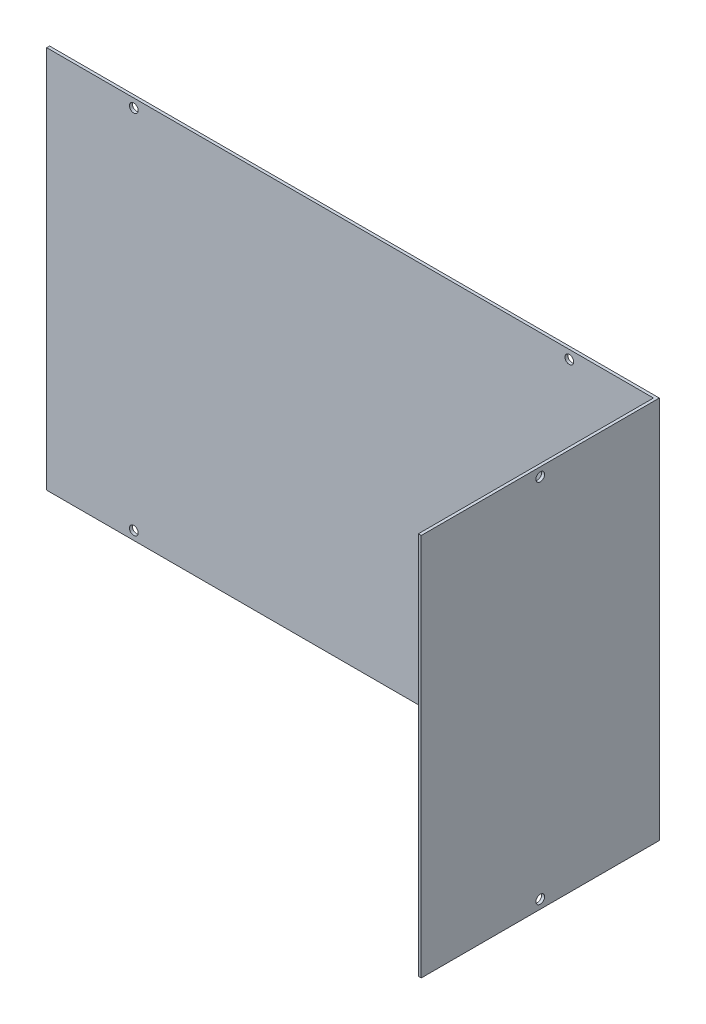
ISO-10303-21;
HEADER;
FILE_DESCRIPTION(('STEP AP214'),'2;1');
FILE_NAME('part.step','',(''),(''),'','','');
FILE_SCHEMA(('AUTOMOTIVE_DESIGN { 1 0 10303 214 1 1 1 1 }'));
ENDSEC;
DATA;
#1=APPLICATION_CONTEXT('core data for automotive mechanical design processes');
#2=APPLICATION_PROTOCOL_DEFINITION('international standard','automotive_design',2000,#1);
#3=PRODUCT_CONTEXT('',#1,'mechanical');
#4=PRODUCT('Part','Part','',(#3));
#5=PRODUCT_RELATED_PRODUCT_CATEGORY('part','',(#4));
#6=PRODUCT_DEFINITION_FORMATION('','',#4);
#7=PRODUCT_DEFINITION_CONTEXT('part definition',#1,'design');
#8=PRODUCT_DEFINITION('design','',#6,#7);
#9=PRODUCT_DEFINITION_SHAPE('','',#8);
#10=(LENGTH_UNIT() NAMED_UNIT(*) SI_UNIT(.MILLI.,.METRE.));
#11=(NAMED_UNIT(*) PLANE_ANGLE_UNIT() SI_UNIT($,.RADIAN.));
#12=(NAMED_UNIT(*) SI_UNIT($,.STERADIAN.) SOLID_ANGLE_UNIT());
#13=UNCERTAINTY_MEASURE_WITH_UNIT(LENGTH_MEASURE(1.E-05),#10,'distance_accuracy_value','');
#14=(GEOMETRIC_REPRESENTATION_CONTEXT(3) GLOBAL_UNCERTAINTY_ASSIGNED_CONTEXT((#13)) GLOBAL_UNIT_ASSIGNED_CONTEXT((#10,
#11,#12)) REPRESENTATION_CONTEXT('',''));
#15=CARTESIAN_POINT('',(0.,0.,0.));
#16=DIRECTION('',(0.,0.,1.));
#17=DIRECTION('',(1.,0.,0.));
#18=AXIS2_PLACEMENT_3D('',#15,#16,#17);
#19=CARTESIAN_POINT('',(0.,0.,1.));
#20=DIRECTION('',(0.,0.,-1.));
#21=DIRECTION('',(-1.,0.,0.));
#22=AXIS2_PLACEMENT_3D('',#19,#20,#21);
#23=PLANE('',#22);
#24=CARTESIAN_POINT('',(75.,-63.,1.));
#25=DIRECTION('',(0.,0.,1.));
#26=DIRECTION('',(1.,0.,0.));
#27=AXIS2_PLACEMENT_3D('',#24,#25,#26);
#28=CIRCLE('',#27,1.5);
#29=CARTESIAN_POINT('',(76.5,-63.,1.));
#30=VERTEX_POINT('',#29);
#31=EDGE_CURVE('E130',#30,#30,#28,.T.);
#32=ORIENTED_EDGE('',*,*,#31,.F.);
#33=EDGE_LOOP('',(#32));
#34=FACE_BOUND('',#33,.T.);
#35=CARTESIAN_POINT('',(-75.,-63.,1.));
#36=DIRECTION('',(0.,0.,1.));
#37=DIRECTION('',(1.,0.,0.));
#38=AXIS2_PLACEMENT_3D('',#35,#36,#37);
#39=CIRCLE('',#38,1.5);
#40=CARTESIAN_POINT('',(-73.5,-63.,1.));
#41=VERTEX_POINT('',#40);
#42=EDGE_CURVE('E146',#41,#41,#39,.T.);
#43=ORIENTED_EDGE('',*,*,#42,.F.);
#44=EDGE_LOOP('',(#43));
#45=FACE_BOUND('',#44,.T.);
#46=CARTESIAN_POINT('',(75.,63.,1.));
#47=DIRECTION('',(0.,0.,1.));
#48=DIRECTION('',(1.,0.,0.));
#49=AXIS2_PLACEMENT_3D('',#46,#47,#48);
#50=CIRCLE('',#49,1.5);
#51=CARTESIAN_POINT('',(76.5,63.,1.));
#52=VERTEX_POINT('',#51);
#53=EDGE_CURVE('E151',#52,#52,#50,.T.);
#54=ORIENTED_EDGE('',*,*,#53,.F.);
#55=EDGE_LOOP('',(#54));
#56=FACE_BOUND('',#55,.T.);
#57=CARTESIAN_POINT('',(-75.,63.,1.));
#58=DIRECTION('',(0.,0.,1.));
#59=DIRECTION('',(1.,0.,0.));
#60=AXIS2_PLACEMENT_3D('',#57,#58,#59);
#61=CIRCLE('',#60,1.5);
#62=CARTESIAN_POINT('',(-73.5,63.,1.));
#63=VERTEX_POINT('',#62);
#64=EDGE_CURVE('E157',#63,#63,#61,.T.);
#65=ORIENTED_EDGE('',*,*,#64,.F.);
#66=EDGE_LOOP('',(#65));
#67=FACE_BOUND('',#66,.T.);
#68=DIRECTION('',(0.,-1.,0.));
#69=VECTOR('',#68,1.);
#70=CARTESIAN_POINT('',(104.,66.,1.));
#71=LINE('',#70,#69);
#72=CARTESIAN_POINT('',(104.,66.,1.));
#73=VERTEX_POINT('',#72);
#74=CARTESIAN_POINT('',(104.,-66.,1.));
#75=VERTEX_POINT('',#74);
#76=EDGE_CURVE('E50',#73,#75,#71,.T.);
#77=ORIENTED_EDGE('',*,*,#76,.F.);
#78=DIRECTION('',(-1.,0.,0.));
#79=VECTOR('',#78,1.);
#80=CARTESIAN_POINT('',(-105.,66.,1.));
#81=LINE('',#80,#79);
#82=CARTESIAN_POINT('',(-105.,66.,1.));
#83=VERTEX_POINT('',#82);
#84=EDGE_CURVE('E55',#73,#83,#81,.T.);
#85=ORIENTED_EDGE('',*,*,#84,.T.);
#86=DIRECTION('',(0.,-1.,0.));
#87=VECTOR('',#86,1.);
#88=CARTESIAN_POINT('',(-105.,-66.,1.));
#89=LINE('',#88,#87);
#90=CARTESIAN_POINT('',(-105.,-66.,1.));
#91=VERTEX_POINT('',#90);
#92=EDGE_CURVE('E86',#83,#91,#89,.T.);
#93=ORIENTED_EDGE('',*,*,#92,.T.);
#94=DIRECTION('',(1.,0.,0.));
#95=VECTOR('',#94,1.);
#96=CARTESIAN_POINT('',(-105.,-66.,1.));
#97=LINE('',#96,#95);
#98=EDGE_CURVE('E110',#91,#75,#97,.T.);
#99=ORIENTED_EDGE('',*,*,#98,.T.);
#100=EDGE_LOOP('',(#77,#85,#93,#99));
#101=FACE_BOUND('',#100,.T.);
#102=ADVANCED_FACE('F33',(#34,#45,#56,#67,#101),#23,.F.);
#103=CARTESIAN_POINT('',(-105.,-66.,1.));
#104=DIRECTION('',(1.,0.,0.));
#105=DIRECTION('',(0.,0.,-1.));
#106=AXIS2_PLACEMENT_3D('',#103,#104,#105);
#107=PLANE('',#106);
#108=DIRECTION('',(0.,-1.,0.));
#109=VECTOR('',#108,1.);
#110=CARTESIAN_POINT('',(-105.,-66.,0.));
#111=LINE('',#110,#109);
#112=CARTESIAN_POINT('',(-105.,66.,0.));
#113=VERTEX_POINT('',#112);
#114=CARTESIAN_POINT('',(-105.,-66.,0.));
#115=VERTEX_POINT('',#114);
#116=EDGE_CURVE('E92',#113,#115,#111,.T.);
#117=ORIENTED_EDGE('',*,*,#116,.T.);
#118=DIRECTION('',(0.,0.,-1.));
#119=VECTOR('',#118,1.);
#120=CARTESIAN_POINT('',(-105.,-66.,1.));
#121=LINE('',#120,#119);
#122=EDGE_CURVE('E11',#91,#115,#121,.T.);
#123=ORIENTED_EDGE('',*,*,#122,.F.);
#124=ORIENTED_EDGE('',*,*,#92,.F.);
#125=DIRECTION('',(0.,0.,-1.));
#126=VECTOR('',#125,1.);
#127=CARTESIAN_POINT('',(-105.,66.,1.));
#128=LINE('',#127,#126);
#129=EDGE_CURVE('E78',#83,#113,#128,.T.);
#130=ORIENTED_EDGE('',*,*,#129,.T.);
#131=EDGE_LOOP('',(#117,#123,#124,#130));
#132=FACE_BOUND('',#131,.T.);
#133=ADVANCED_FACE('F35',(#132),#107,.F.);
#134=CARTESIAN_POINT('',(-105.,-66.,1.));
#135=DIRECTION('',(0.,1.,0.));
#136=DIRECTION('',(0.,0.,1.));
#137=AXIS2_PLACEMENT_3D('',#134,#135,#136);
#138=PLANE('',#137);
#139=DIRECTION('',(1.,0.,0.));
#140=VECTOR('',#139,1.);
#141=CARTESIAN_POINT('',(-105.,-66.,0.));
#142=LINE('',#141,#140);
#143=CARTESIAN_POINT('',(105.,-66.,0.));
#144=VERTEX_POINT('',#143);
#145=EDGE_CURVE('E95',#115,#144,#142,.T.);
#146=ORIENTED_EDGE('',*,*,#145,.T.);
#147=DIRECTION('',(0.,0.,-1.));
#148=VECTOR('',#147,1.);
#149=CARTESIAN_POINT('',(105.,-66.,1.));
#150=LINE('',#149,#148);
#151=CARTESIAN_POINT('',(105.,-66.,82.));
#152=VERTEX_POINT('',#151);
#153=EDGE_CURVE('E42',#152,#144,#150,.T.);
#154=ORIENTED_EDGE('',*,*,#153,.F.);
#155=DIRECTION('',(1.,0.,0.));
#156=VECTOR('',#155,1.);
#157=CARTESIAN_POINT('',(104.,-66.,82.));
#158=LINE('',#157,#156);
#159=CARTESIAN_POINT('',(104.,-66.,82.));
#160=VERTEX_POINT('',#159);
#161=EDGE_CURVE('E166',#160,#152,#158,.T.);
#162=ORIENTED_EDGE('',*,*,#161,.F.);
#163=DIRECTION('',(0.,0.,-1.));
#164=VECTOR('',#163,1.);
#165=CARTESIAN_POINT('',(104.,-66.,82.));
#166=LINE('',#165,#164);
#167=EDGE_CURVE('E96',#160,#75,#166,.T.);
#168=ORIENTED_EDGE('',*,*,#167,.T.);
#169=ORIENTED_EDGE('',*,*,#98,.F.);
#170=ORIENTED_EDGE('',*,*,#122,.T.);
#171=EDGE_LOOP('',(#146,#154,#162,#168,#169,#170));
#172=FACE_BOUND('',#171,.T.);
#173=ADVANCED_FACE('F187',(#172),#138,.F.);
#174=CARTESIAN_POINT('',(105.,-66.,1.));
#175=DIRECTION('',(-1.,0.,0.));
#176=DIRECTION('',(0.,-1.,0.));
#177=AXIS2_PLACEMENT_3D('',#174,#175,#176);
#178=PLANE('',#177);
#179=CARTESIAN_POINT('',(105.,-63.,41.));
#180=DIRECTION('',(1.,0.,0.));
#181=DIRECTION('',(0.,1.,0.));
#182=AXIS2_PLACEMENT_3D('',#179,#180,#181);
#183=CIRCLE('',#182,1.5);
#184=CARTESIAN_POINT('',(105.,-61.5,41.));
#185=VERTEX_POINT('',#184);
#186=EDGE_CURVE('E142',#185,#185,#183,.T.);
#187=ORIENTED_EDGE('',*,*,#186,.F.);
#188=EDGE_LOOP('',(#187));
#189=FACE_BOUND('',#188,.T.);
#190=CARTESIAN_POINT('',(105.,63.,41.));
#191=DIRECTION('',(1.,0.,0.));
#192=DIRECTION('',(0.,1.,0.));
#193=AXIS2_PLACEMENT_3D('',#190,#191,#192);
#194=CIRCLE('',#193,1.5);
#195=CARTESIAN_POINT('',(105.,64.5,41.));
#196=VERTEX_POINT('',#195);
#197=EDGE_CURVE('E131',#196,#196,#194,.T.);
#198=ORIENTED_EDGE('',*,*,#197,.F.);
#199=EDGE_LOOP('',(#198));
#200=FACE_BOUND('',#199,.T.);
#201=DIRECTION('',(0.,1.,0.));
#202=VECTOR('',#201,1.);
#203=CARTESIAN_POINT('',(105.,-66.,0.));
#204=LINE('',#203,#202);
#205=CARTESIAN_POINT('',(105.,66.,0.));
#206=VERTEX_POINT('',#205);
#207=EDGE_CURVE('E87',#144,#206,#204,.T.);
#208=ORIENTED_EDGE('',*,*,#207,.T.);
#209=DIRECTION('',(0.,0.,-1.));
#210=VECTOR('',#209,1.);
#211=CARTESIAN_POINT('',(105.,66.,1.));
#212=LINE('',#211,#210);
#213=CARTESIAN_POINT('',(105.,66.,82.));
#214=VERTEX_POINT('',#213);
#215=EDGE_CURVE('E82',#214,#206,#212,.T.);
#216=ORIENTED_EDGE('',*,*,#215,.F.);
#217=DIRECTION('',(0.,1.,0.));
#218=VECTOR('',#217,1.);
#219=CARTESIAN_POINT('',(105.,66.,82.));
#220=LINE('',#219,#218);
#221=EDGE_CURVE('E168',#152,#214,#220,.T.);
#222=ORIENTED_EDGE('',*,*,#221,.F.);
#223=ORIENTED_EDGE('',*,*,#153,.T.);
#224=EDGE_LOOP('',(#208,#216,#222,#223));
#225=FACE_BOUND('',#224,.T.);
#226=ADVANCED_FACE('F192',(#189,#200,#225),#178,.F.);
#227=CARTESIAN_POINT('',(-105.,66.,1.));
#228=DIRECTION('',(0.,-1.,0.));
#229=DIRECTION('',(1.,0.,0.));
#230=AXIS2_PLACEMENT_3D('',#227,#228,#229);
#231=PLANE('',#230);
#232=DIRECTION('',(-1.,0.,0.));
#233=VECTOR('',#232,1.);
#234=CARTESIAN_POINT('',(-105.,66.,0.));
#235=LINE('',#234,#233);
#236=EDGE_CURVE('E75',#206,#113,#235,.T.);
#237=ORIENTED_EDGE('',*,*,#236,.T.);
#238=ORIENTED_EDGE('',*,*,#129,.F.);
#239=ORIENTED_EDGE('',*,*,#84,.F.);
#240=DIRECTION('',(0.,0.,-1.));
#241=VECTOR('',#240,1.);
#242=CARTESIAN_POINT('',(104.,66.,82.));
#243=LINE('',#242,#241);
#244=CARTESIAN_POINT('',(104.,66.,82.));
#245=VERTEX_POINT('',#244);
#246=EDGE_CURVE('E100',#245,#73,#243,.T.);
#247=ORIENTED_EDGE('',*,*,#246,.F.);
#248=DIRECTION('',(-1.,0.,0.));
#249=VECTOR('',#248,1.);
#250=CARTESIAN_POINT('',(104.,66.,82.));
#251=LINE('',#250,#249);
#252=EDGE_CURVE('E117',#214,#245,#251,.T.);
#253=ORIENTED_EDGE('',*,*,#252,.F.);
#254=ORIENTED_EDGE('',*,*,#215,.T.);
#255=EDGE_LOOP('',(#237,#238,#239,#247,#253,#254));
#256=FACE_BOUND('',#255,.T.);
#257=ADVANCED_FACE('F77',(#256),#231,.F.);
#258=CARTESIAN_POINT('',(0.,0.,0.));
#259=DIRECTION('',(0.,0.,-1.));
#260=DIRECTION('',(-1.,0.,0.));
#261=AXIS2_PLACEMENT_3D('',#258,#259,#260);
#262=PLANE('',#261);
#263=CARTESIAN_POINT('',(75.,-63.,0.));
#264=DIRECTION('',(0.,0.,1.));
#265=DIRECTION('',(1.,0.,0.));
#266=AXIS2_PLACEMENT_3D('',#263,#264,#265);
#267=CIRCLE('',#266,1.5);
#268=CARTESIAN_POINT('',(76.5,-63.,0.));
#269=VERTEX_POINT('',#268);
#270=EDGE_CURVE('E135',#269,#269,#267,.T.);
#271=ORIENTED_EDGE('',*,*,#270,.T.);
#272=EDGE_LOOP('',(#271));
#273=FACE_BOUND('',#272,.T.);
#274=CARTESIAN_POINT('',(-75.,-63.,0.));
#275=DIRECTION('',(0.,0.,1.));
#276=DIRECTION('',(1.,0.,0.));
#277=AXIS2_PLACEMENT_3D('',#274,#275,#276);
#278=CIRCLE('',#277,1.5);
#279=CARTESIAN_POINT('',(-73.5,-63.,0.));
#280=VERTEX_POINT('',#279);
#281=EDGE_CURVE('E148',#280,#280,#278,.T.);
#282=ORIENTED_EDGE('',*,*,#281,.T.);
#283=EDGE_LOOP('',(#282));
#284=FACE_BOUND('',#283,.T.);
#285=CARTESIAN_POINT('',(75.,63.,0.));
#286=DIRECTION('',(0.,0.,1.));
#287=DIRECTION('',(1.,0.,0.));
#288=AXIS2_PLACEMENT_3D('',#285,#286,#287);
#289=CIRCLE('',#288,1.5);
#290=CARTESIAN_POINT('',(76.5,63.,0.));
#291=VERTEX_POINT('',#290);
#292=EDGE_CURVE('E154',#291,#291,#289,.T.);
#293=ORIENTED_EDGE('',*,*,#292,.T.);
#294=EDGE_LOOP('',(#293));
#295=FACE_BOUND('',#294,.T.);
#296=CARTESIAN_POINT('',(-75.,63.,0.));
#297=DIRECTION('',(0.,0.,1.));
#298=DIRECTION('',(1.,0.,0.));
#299=AXIS2_PLACEMENT_3D('',#296,#297,#298);
#300=CIRCLE('',#299,1.5);
#301=CARTESIAN_POINT('',(-73.5,63.,0.));
#302=VERTEX_POINT('',#301);
#303=EDGE_CURVE('E123',#302,#302,#300,.T.);
#304=ORIENTED_EDGE('',*,*,#303,.T.);
#305=EDGE_LOOP('',(#304));
#306=FACE_BOUND('',#305,.T.);
#307=ORIENTED_EDGE('',*,*,#116,.F.);
#308=ORIENTED_EDGE('',*,*,#236,.F.);
#309=ORIENTED_EDGE('',*,*,#207,.F.);
#310=ORIENTED_EDGE('',*,*,#145,.F.);
#311=EDGE_LOOP('',(#307,#308,#309,#310));
#312=FACE_BOUND('',#311,.T.);
#313=ADVANCED_FACE('F94',(#273,#284,#295,#306,#312),#262,.T.);
#314=CARTESIAN_POINT('',(104.,66.,82.));
#315=DIRECTION('',(1.,0.,0.));
#316=DIRECTION('',(0.,0.,-1.));
#317=AXIS2_PLACEMENT_3D('',#314,#315,#316);
#318=PLANE('',#317);
#319=CARTESIAN_POINT('',(104.,-63.,41.));
#320=DIRECTION('',(1.,0.,0.));
#321=DIRECTION('',(0.,0.,-1.));
#322=AXIS2_PLACEMENT_3D('',#319,#320,#321);
#323=CIRCLE('',#322,1.5);
#324=CARTESIAN_POINT('',(104.,-63.,39.5));
#325=VERTEX_POINT('',#324);
#326=EDGE_CURVE('E37',#325,#325,#323,.T.);
#327=ORIENTED_EDGE('',*,*,#326,.T.);
#328=EDGE_LOOP('',(#327));
#329=FACE_BOUND('',#328,.T.);
#330=CARTESIAN_POINT('',(104.,63.,41.));
#331=DIRECTION('',(1.,0.,0.));
#332=DIRECTION('',(0.,0.,-1.));
#333=AXIS2_PLACEMENT_3D('',#330,#331,#332);
#334=CIRCLE('',#333,1.5);
#335=CARTESIAN_POINT('',(104.,63.,39.5));
#336=VERTEX_POINT('',#335);
#337=EDGE_CURVE('E128',#336,#336,#334,.T.);
#338=ORIENTED_EDGE('',*,*,#337,.T.);
#339=EDGE_LOOP('',(#338));
#340=FACE_BOUND('',#339,.T.);
#341=ORIENTED_EDGE('',*,*,#76,.T.);
#342=ORIENTED_EDGE('',*,*,#167,.F.);
#343=DIRECTION('',(0.,-1.,0.));
#344=VECTOR('',#343,1.);
#345=CARTESIAN_POINT('',(104.,66.,82.));
#346=LINE('',#345,#344);
#347=EDGE_CURVE('E122',#245,#160,#346,.T.);
#348=ORIENTED_EDGE('',*,*,#347,.F.);
#349=ORIENTED_EDGE('',*,*,#246,.T.);
#350=EDGE_LOOP('',(#341,#342,#348,#349));
#351=FACE_BOUND('',#350,.T.);
#352=ADVANCED_FACE('F181',(#329,#340,#351),#318,.F.);
#353=CARTESIAN_POINT('',(0.,0.,82.));
#354=DIRECTION('',(0.,0.,1.));
#355=DIRECTION('',(1.,0.,0.));
#356=AXIS2_PLACEMENT_3D('',#353,#354,#355);
#357=PLANE('',#356);
#358=ORIENTED_EDGE('',*,*,#347,.T.);
#359=ORIENTED_EDGE('',*,*,#161,.T.);
#360=ORIENTED_EDGE('',*,*,#221,.T.);
#361=ORIENTED_EDGE('',*,*,#252,.T.);
#362=EDGE_LOOP('',(#358,#359,#360,#361));
#363=FACE_BOUND('',#362,.T.);
#364=ADVANCED_FACE('F175',(#363),#357,.T.);
#365=CARTESIAN_POINT('',(-75.,63.,0.));
#366=DIRECTION('',(0.,0.,1.));
#367=DIRECTION('',(1.,0.,0.));
#368=AXIS2_PLACEMENT_3D('',#365,#366,#367);
#369=CYLINDRICAL_SURFACE('',#368,1.5);
#370=ORIENTED_EDGE('',*,*,#303,.F.);
#371=EDGE_LOOP('',(#370));
#372=FACE_BOUND('',#371,.T.);
#373=ORIENTED_EDGE('',*,*,#64,.T.);
#374=EDGE_LOOP('',(#373));
#375=FACE_BOUND('',#374,.T.);
#376=ADVANCED_FACE('F228',(#372,#375),#369,.F.);
#377=CARTESIAN_POINT('',(75.,63.,0.));
#378=DIRECTION('',(0.,0.,1.));
#379=DIRECTION('',(1.,0.,0.));
#380=AXIS2_PLACEMENT_3D('',#377,#378,#379);
#381=CYLINDRICAL_SURFACE('',#380,1.5);
#382=ORIENTED_EDGE('',*,*,#292,.F.);
#383=EDGE_LOOP('',(#382));
#384=FACE_BOUND('',#383,.T.);
#385=ORIENTED_EDGE('',*,*,#53,.T.);
#386=EDGE_LOOP('',(#385));
#387=FACE_BOUND('',#386,.T.);
#388=ADVANCED_FACE('F231',(#384,#387),#381,.F.);
#389=CARTESIAN_POINT('',(-75.,-63.,0.));
#390=DIRECTION('',(0.,0.,1.));
#391=DIRECTION('',(1.,0.,0.));
#392=AXIS2_PLACEMENT_3D('',#389,#390,#391);
#393=CYLINDRICAL_SURFACE('',#392,1.5);
#394=ORIENTED_EDGE('',*,*,#281,.F.);
#395=EDGE_LOOP('',(#394));
#396=FACE_BOUND('',#395,.T.);
#397=ORIENTED_EDGE('',*,*,#42,.T.);
#398=EDGE_LOOP('',(#397));
#399=FACE_BOUND('',#398,.T.);
#400=ADVANCED_FACE('F239',(#396,#399),#393,.F.);
#401=CARTESIAN_POINT('',(75.,-63.,0.));
#402=DIRECTION('',(0.,0.,1.));
#403=DIRECTION('',(1.,0.,0.));
#404=AXIS2_PLACEMENT_3D('',#401,#402,#403);
#405=CYLINDRICAL_SURFACE('',#404,1.5);
#406=ORIENTED_EDGE('',*,*,#270,.F.);
#407=EDGE_LOOP('',(#406));
#408=FACE_BOUND('',#407,.T.);
#409=ORIENTED_EDGE('',*,*,#31,.T.);
#410=EDGE_LOOP('',(#409));
#411=FACE_BOUND('',#410,.T.);
#412=ADVANCED_FACE('F245',(#408,#411),#405,.F.);
#413=CARTESIAN_POINT('',(-105.000025,63.,41.));
#414=DIRECTION('',(1.,0.,0.));
#415=DIRECTION('',(0.,1.,0.));
#416=AXIS2_PLACEMENT_3D('',#413,#414,#415);
#417=CYLINDRICAL_SURFACE('',#416,1.5);
#418=ORIENTED_EDGE('',*,*,#197,.T.);
#419=EDGE_LOOP('',(#418));
#420=FACE_BOUND('',#419,.T.);
#421=ORIENTED_EDGE('',*,*,#337,.F.);
#422=EDGE_LOOP('',(#421));
#423=FACE_BOUND('',#422,.T.);
#424=ADVANCED_FACE('F249',(#420,#423),#417,.F.);
#425=CARTESIAN_POINT('',(-105.000025,-63.,41.));
#426=DIRECTION('',(1.,0.,0.));
#427=DIRECTION('',(0.,1.,0.));
#428=AXIS2_PLACEMENT_3D('',#425,#426,#427);
#429=CYLINDRICAL_SURFACE('',#428,1.5);
#430=ORIENTED_EDGE('',*,*,#186,.T.);
#431=EDGE_LOOP('',(#430));
#432=FACE_BOUND('',#431,.T.);
#433=ORIENTED_EDGE('',*,*,#326,.F.);
#434=EDGE_LOOP('',(#433));
#435=FACE_BOUND('',#434,.T.);
#436=ADVANCED_FACE('F253',(#432,#435),#429,.F.);
#437=CLOSED_SHELL('',(#102,#133,#173,#226,#257,#313,#352,#364,#376,#388,#400,#412,#424,#436));
#438=MANIFOLD_SOLID_BREP('B2',#437);
#439=ADVANCED_BREP_SHAPE_REPRESENTATION('',(#18,#438),#14);
#440=SHAPE_DEFINITION_REPRESENTATION(#9,#439);
ENDSEC;
END-ISO-10303-21;
